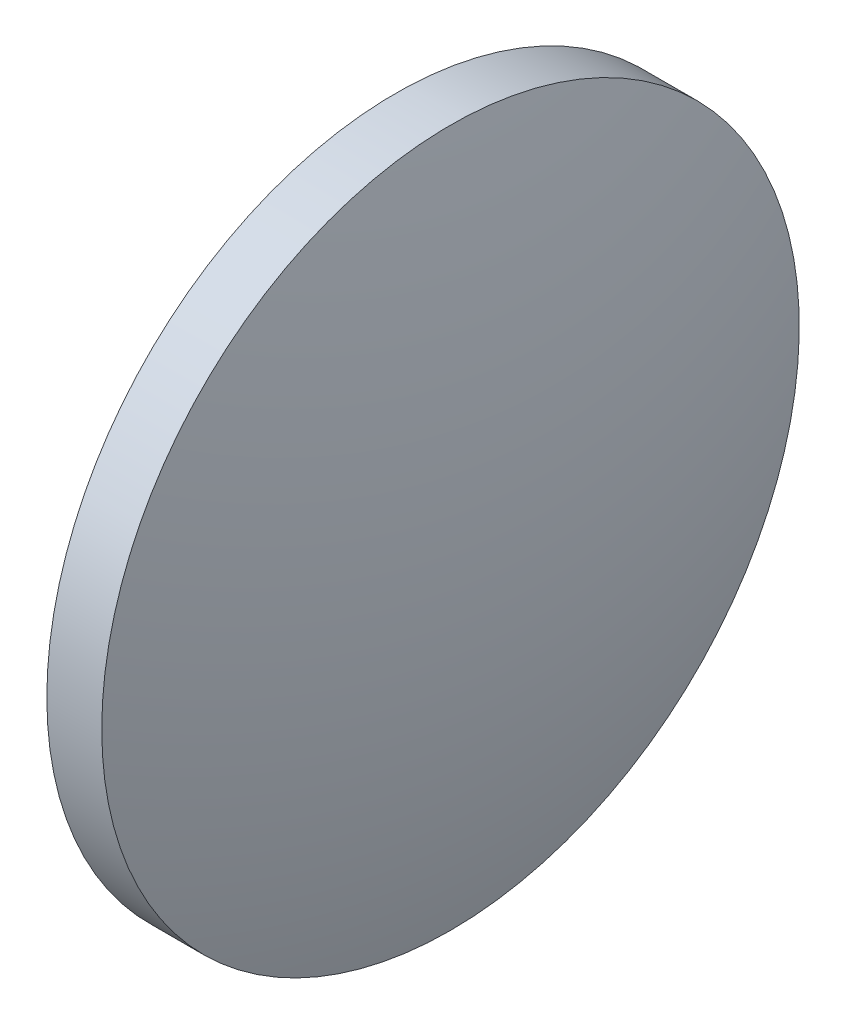
ISO-10303-21;
HEADER;
FILE_DESCRIPTION(('STEP AP214'),'2;1');
FILE_NAME('part.step','',(''),(''),'','','');
FILE_SCHEMA(('AUTOMOTIVE_DESIGN { 1 0 10303 214 1 1 1 1 }'));
ENDSEC;
DATA;
#1=APPLICATION_CONTEXT('core data for automotive mechanical design processes');
#2=APPLICATION_PROTOCOL_DEFINITION('international standard','automotive_design',2000,#1);
#3=PRODUCT_CONTEXT('',#1,'mechanical');
#4=PRODUCT('Part','Part','',(#3));
#5=PRODUCT_RELATED_PRODUCT_CATEGORY('part','',(#4));
#6=PRODUCT_DEFINITION_FORMATION('','',#4);
#7=PRODUCT_DEFINITION_CONTEXT('part definition',#1,'design');
#8=PRODUCT_DEFINITION('design','',#6,#7);
#9=PRODUCT_DEFINITION_SHAPE('','',#8);
#10=(LENGTH_UNIT() NAMED_UNIT(*) SI_UNIT(.MILLI.,.METRE.));
#11=(NAMED_UNIT(*) PLANE_ANGLE_UNIT() SI_UNIT($,.RADIAN.));
#12=(NAMED_UNIT(*) SI_UNIT($,.STERADIAN.) SOLID_ANGLE_UNIT());
#13=UNCERTAINTY_MEASURE_WITH_UNIT(LENGTH_MEASURE(1.E-05),#10,'distance_accuracy_value','');
#14=(GEOMETRIC_REPRESENTATION_CONTEXT(3) GLOBAL_UNCERTAINTY_ASSIGNED_CONTEXT((#13)) GLOBAL_UNIT_ASSIGNED_CONTEXT((#10,
#11,#12)) REPRESENTATION_CONTEXT('',''));
#15=CARTESIAN_POINT('',(0.,0.,0.));
#16=DIRECTION('',(0.,0.,1.));
#17=DIRECTION('',(1.,0.,0.));
#18=AXIS2_PLACEMENT_3D('',#15,#16,#17);
#19=CARTESIAN_POINT('',(488.888113818836,102.459533872913,0.));
#20=DIRECTION('',(-1.,0.,0.));
#21=DIRECTION('',(0.,-1.,0.));
#22=AXIS2_PLACEMENT_3D('',#19,#20,#21);
#23=SPHERICAL_SURFACE('',#22,43.3947368421051);
#24=CARTESIAN_POINT('',(530.382850660942,102.459533872913,0.));
#25=DIRECTION('',(-1.,0.,0.));
#26=DIRECTION('',(0.,0.,1.));
#27=AXIS2_PLACEMENT_3D('',#24,#25,#26);
#28=CIRCLE('',#27,12.7);
#29=CARTESIAN_POINT('',(530.382850660942,102.459533872913,12.7));
#30=VERTEX_POINT('',#29);
#31=EDGE_CURVE('E10',#30,#30,#28,.T.);
#32=ORIENTED_EDGE('',*,*,#31,.F.);
#33=EDGE_LOOP('',(#32));
#34=FACE_BOUND('',#33,.T.);
#35=ADVANCED_FACE('F35',(#34),#23,.T.);
#36=CARTESIAN_POINT('',(522.644632625265,102.459533872913,0.));
#37=DIRECTION('',(-1.,0.,0.));
#38=DIRECTION('',(0.,0.,1.));
#39=AXIS2_PLACEMENT_3D('',#36,#37,#38);
#40=CYLINDRICAL_SURFACE('',#39,12.7);
#41=CARTESIAN_POINT('',(528.382850660942,102.459533872913,0.));
#42=DIRECTION('',(-1.,0.,0.));
#43=DIRECTION('',(0.,0.,1.));
#44=AXIS2_PLACEMENT_3D('',#41,#42,#43);
#45=CIRCLE('',#44,12.7);
#46=CARTESIAN_POINT('',(528.382850660942,102.459533872913,12.7));
#47=VERTEX_POINT('',#46);
#48=EDGE_CURVE('E41',#47,#47,#45,.T.);
#49=ORIENTED_EDGE('',*,*,#48,.F.);
#50=EDGE_LOOP('',(#49));
#51=FACE_BOUND('',#50,.T.);
#52=ORIENTED_EDGE('',*,*,#31,.T.);
#53=EDGE_LOOP('',(#52));
#54=FACE_BOUND('',#53,.T.);
#55=ADVANCED_FACE('F49',(#51,#54),#40,.T.);
#56=CARTESIAN_POINT('',(528.382850660942,102.459533872913,0.));
#57=DIRECTION('',(1.,0.,0.));
#58=DIRECTION('',(0.,0.,-1.));
#59=AXIS2_PLACEMENT_3D('',#56,#57,#58);
#60=PLANE('',#59);
#61=ORIENTED_EDGE('',*,*,#48,.T.);
#62=EDGE_LOOP('',(#61));
#63=FACE_BOUND('',#62,.T.);
#64=ADVANCED_FACE('F47',(#63),#60,.F.);
#65=CLOSED_SHELL('',(#35,#55,#64));
#66=MANIFOLD_SOLID_BREP('B2',#65);
#67=ADVANCED_BREP_SHAPE_REPRESENTATION('',(#18,#66),#14);
#68=SHAPE_DEFINITION_REPRESENTATION(#9,#67);
ENDSEC;
END-ISO-10303-21;
